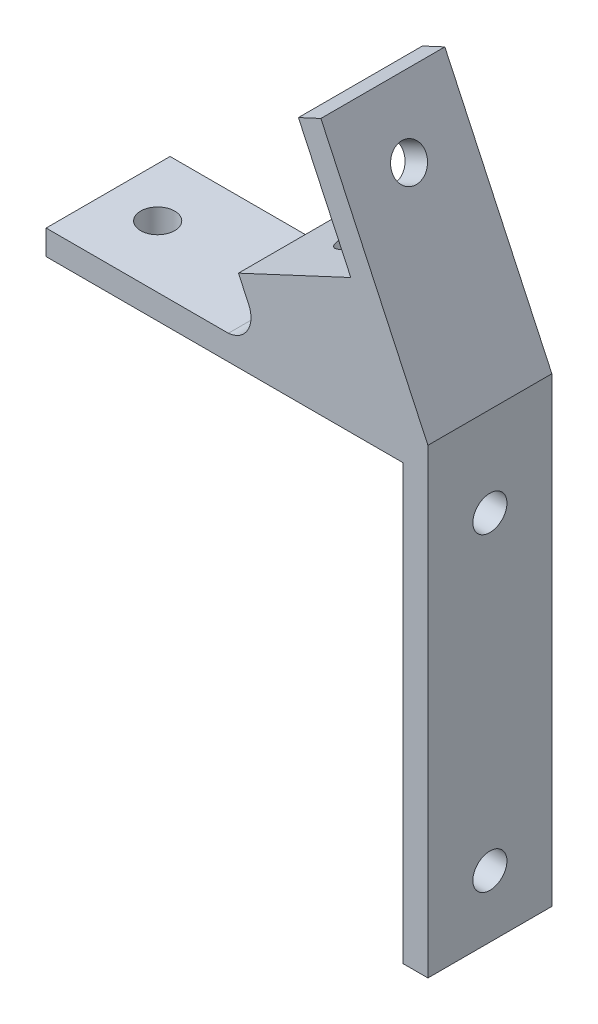
ISO-10303-21;
HEADER;
FILE_DESCRIPTION(('STEP AP214'),'2;1');
FILE_NAME('part.step','',(''),(''),'','','');
FILE_SCHEMA(('AUTOMOTIVE_DESIGN { 1 0 10303 214 1 1 1 1 }'));
ENDSEC;
DATA;
#1=APPLICATION_CONTEXT('core data for automotive mechanical design processes');
#2=APPLICATION_PROTOCOL_DEFINITION('international standard','automotive_design',2000,#1);
#3=PRODUCT_CONTEXT('',#1,'mechanical');
#4=PRODUCT('Part','Part','',(#3));
#5=PRODUCT_RELATED_PRODUCT_CATEGORY('part','',(#4));
#6=PRODUCT_DEFINITION_FORMATION('','',#4);
#7=PRODUCT_DEFINITION_CONTEXT('part definition',#1,'design');
#8=PRODUCT_DEFINITION('design','',#6,#7);
#9=PRODUCT_DEFINITION_SHAPE('','',#8);
#10=(LENGTH_UNIT() NAMED_UNIT(*) SI_UNIT(.MILLI.,.METRE.));
#11=(NAMED_UNIT(*) PLANE_ANGLE_UNIT() SI_UNIT($,.RADIAN.));
#12=(NAMED_UNIT(*) SI_UNIT($,.STERADIAN.) SOLID_ANGLE_UNIT());
#13=UNCERTAINTY_MEASURE_WITH_UNIT(LENGTH_MEASURE(1.E-05),#10,'distance_accuracy_value','');
#14=(GEOMETRIC_REPRESENTATION_CONTEXT(3) GLOBAL_UNCERTAINTY_ASSIGNED_CONTEXT((#13)) GLOBAL_UNIT_ASSIGNED_CONTEXT((#10,
#11,#12)) REPRESENTATION_CONTEXT('',''));
#15=CARTESIAN_POINT('',(0.,0.,0.));
#16=DIRECTION('',(0.,0.,1.));
#17=DIRECTION('',(1.,0.,0.));
#18=AXIS2_PLACEMENT_3D('',#15,#16,#17);
#19=CARTESIAN_POINT('',(-3.99999973673621,0.,20.));
#20=DIRECTION('',(-1.,0.,0.));
#21=DIRECTION('',(0.,0.,1.));
#22=AXIS2_PLACEMENT_3D('',#19,#20,#21);
#23=PLANE('',#22);
#24=CARTESIAN_POINT('',(-3.99999973673621,9.99996286389591,9.9999995));
#25=DIRECTION('',(-1.,0.,0.));
#26=DIRECTION('',(0.,0.,1.));
#27=AXIS2_PLACEMENT_3D('',#24,#25,#26);
#28=CIRCLE('',#27,2.74999594956033);
#29=CARTESIAN_POINT('',(-3.99999973673621,9.99996286389591,12.7499954495603));
#30=VERTEX_POINT('',#29);
#31=EDGE_CURVE('E316',#30,#30,#28,.T.);
#32=ORIENTED_EDGE('',*,*,#31,.F.);
#33=EDGE_LOOP('',(#32));
#34=FACE_BOUND('',#33,.T.);
#35=CARTESIAN_POINT('',(-3.99999973673621,59.9999776734455,9.9999995));
#36=DIRECTION('',(-1.,0.,0.));
#37=DIRECTION('',(0.,0.,1.));
#38=AXIS2_PLACEMENT_3D('',#35,#36,#37);
#39=CIRCLE('',#38,2.74999594960124);
#40=CARTESIAN_POINT('',(-3.99999973673621,59.9999776734455,12.7499954496012));
#41=VERTEX_POINT('',#40);
#42=EDGE_CURVE('E323',#41,#41,#39,.T.);
#43=ORIENTED_EDGE('',*,*,#42,.F.);
#44=EDGE_LOOP('',(#43));
#45=FACE_BOUND('',#44,.T.);
#46=DIRECTION('',(0.,1.,0.));
#47=VECTOR('',#46,1.);
#48=CARTESIAN_POINT('',(-3.99999973673621,0.,0.));
#49=LINE('',#48,#47);
#50=CARTESIAN_POINT('',(-3.99999973673621,0.,0.));
#51=VERTEX_POINT('',#50);
#52=CARTESIAN_POINT('',(-3.99999973673621,69.9999692632638,0.));
#53=VERTEX_POINT('',#52);
#54=EDGE_CURVE('E153',#51,#53,#49,.T.);
#55=ORIENTED_EDGE('',*,*,#54,.F.);
#56=DIRECTION('',(0.,0.,-1.));
#57=VECTOR('',#56,1.);
#58=CARTESIAN_POINT('',(-3.99999973673621,0.,20.));
#59=LINE('',#58,#57);
#60=CARTESIAN_POINT('',(-3.99999973673621,0.,20.));
#61=VERTEX_POINT('',#60);
#62=EDGE_CURVE('E12',#61,#51,#59,.T.);
#63=ORIENTED_EDGE('',*,*,#62,.F.);
#64=DIRECTION('',(0.,1.,0.));
#65=VECTOR('',#64,1.);
#66=CARTESIAN_POINT('',(-3.99999973673621,0.,20.));
#67=LINE('',#66,#65);
#68=CARTESIAN_POINT('',(-3.99999973673621,69.9999692632638,20.));
#69=VERTEX_POINT('',#68);
#70=EDGE_CURVE('E182',#61,#69,#67,.T.);
#71=ORIENTED_EDGE('',*,*,#70,.T.);
#72=DIRECTION('',(0.,0.,-1.));
#73=VECTOR('',#72,1.);
#74=CARTESIAN_POINT('',(-3.99999973673621,69.9999692632638,20.));
#75=LINE('',#74,#73);
#76=EDGE_CURVE('E38',#69,#53,#75,.T.);
#77=ORIENTED_EDGE('',*,*,#76,.T.);
#78=EDGE_LOOP('',(#55,#63,#71,#77));
#79=FACE_BOUND('',#78,.T.);
#80=ADVANCED_FACE('F35',(#34,#45,#79),#23,.T.);
#81=CARTESIAN_POINT('',(0.,0.,20.));
#82=DIRECTION('',(0.,-1.,0.));
#83=DIRECTION('',(1.,0.,0.));
#84=AXIS2_PLACEMENT_3D('',#81,#82,#83);
#85=PLANE('',#84);
#86=DIRECTION('',(-1.,0.,0.));
#87=VECTOR('',#86,1.);
#88=CARTESIAN_POINT('',(0.,0.,0.));
#89=LINE('',#88,#87);
#90=CARTESIAN_POINT('',(0.,0.,0.));
#91=VERTEX_POINT('',#90);
#92=EDGE_CURVE('E180',#91,#51,#89,.T.);
#93=ORIENTED_EDGE('',*,*,#92,.F.);
#94=DIRECTION('',(0.,0.,-1.));
#95=VECTOR('',#94,1.);
#96=CARTESIAN_POINT('',(0.,0.,20.));
#97=LINE('',#96,#95);
#98=CARTESIAN_POINT('',(0.,0.,20.));
#99=VERTEX_POINT('',#98);
#100=EDGE_CURVE('E44',#99,#91,#97,.T.);
#101=ORIENTED_EDGE('',*,*,#100,.F.);
#102=DIRECTION('',(-1.,0.,0.));
#103=VECTOR('',#102,1.);
#104=CARTESIAN_POINT('',(0.,0.,20.));
#105=LINE('',#104,#103);
#106=EDGE_CURVE('E148',#99,#61,#105,.T.);
#107=ORIENTED_EDGE('',*,*,#106,.T.);
#108=ORIENTED_EDGE('',*,*,#62,.T.);
#109=EDGE_LOOP('',(#93,#101,#107,#108));
#110=FACE_BOUND('',#109,.T.);
#111=ADVANCED_FACE('F206',(#110),#85,.T.);
#112=CARTESIAN_POINT('',(0.,74.4401887277319,20.));
#113=DIRECTION('',(1.,0.,0.));
#114=DIRECTION('',(0.,1.,0.));
#115=AXIS2_PLACEMENT_3D('',#112,#113,#114);
#116=PLANE('',#115);
#117=CARTESIAN_POINT('',(0.,9.99996286389591,9.9999995));
#118=DIRECTION('',(1.,0.,0.));
#119=DIRECTION('',(0.,1.,0.));
#120=AXIS2_PLACEMENT_3D('',#117,#118,#119);
#121=CIRCLE('',#120,2.74999594956033);
#122=CARTESIAN_POINT('',(0.,12.7499588134562,9.9999995));
#123=VERTEX_POINT('',#122);
#124=EDGE_CURVE('E313',#123,#123,#121,.F.);
#125=ORIENTED_EDGE('',*,*,#124,.T.);
#126=EDGE_LOOP('',(#125));
#127=FACE_BOUND('',#126,.T.);
#128=CARTESIAN_POINT('',(0.,59.9999776734455,9.9999995));
#129=DIRECTION('',(1.,0.,0.));
#130=DIRECTION('',(0.,1.,0.));
#131=AXIS2_PLACEMENT_3D('',#128,#129,#130);
#132=CIRCLE('',#131,2.74999594960124);
#133=CARTESIAN_POINT('',(0.,62.7499736230467,9.9999995));
#134=VERTEX_POINT('',#133);
#135=EDGE_CURVE('E321',#134,#134,#132,.F.);
#136=ORIENTED_EDGE('',*,*,#135,.T.);
#137=EDGE_LOOP('',(#136));
#138=FACE_BOUND('',#137,.T.);
#139=DIRECTION('',(0.,-1.,0.));
#140=VECTOR('',#139,1.);
#141=CARTESIAN_POINT('',(0.,74.4401887277319,0.));
#142=LINE('',#141,#140);
#143=CARTESIAN_POINT('',(0.,74.4401887277319,0.));
#144=VERTEX_POINT('',#143);
#145=EDGE_CURVE('E134',#144,#91,#142,.T.);
#146=ORIENTED_EDGE('',*,*,#145,.F.);
#147=DIRECTION('',(0.,0.,-1.));
#148=VECTOR('',#147,1.);
#149=CARTESIAN_POINT('',(0.,74.4401887277319,20.));
#150=LINE('',#149,#148);
#151=CARTESIAN_POINT('',(0.,74.4401887277319,20.));
#152=VERTEX_POINT('',#151);
#153=EDGE_CURVE('E128',#152,#144,#150,.T.);
#154=ORIENTED_EDGE('',*,*,#153,.F.);
#155=DIRECTION('',(0.,-1.,0.));
#156=VECTOR('',#155,1.);
#157=CARTESIAN_POINT('',(0.,74.4401887277319,20.));
#158=LINE('',#157,#156);
#159=EDGE_CURVE('E132',#152,#99,#158,.T.);
#160=ORIENTED_EDGE('',*,*,#159,.T.);
#161=ORIENTED_EDGE('',*,*,#100,.T.);
#162=EDGE_LOOP('',(#146,#154,#160,#161));
#163=FACE_BOUND('',#162,.T.);
#164=ADVANCED_FACE('F130',(#127,#138,#163),#116,.T.);
#165=CARTESIAN_POINT('',(0.,74.4401887277319,20.));
#166=DIRECTION('',(-0.906306534690721,-0.422620947394823,0.));
#167=DIRECTION('',(0.422620947394823,-0.906306534690721,0.));
#168=AXIS2_PLACEMENT_3D('',#165,#166,#167);
#169=PLANE('',#168);
#170=CARTESIAN_POINT('',(-13.0466278180074,102.41855591475,10.0000092704325));
#171=DIRECTION('',(0.906306534690721,0.422620947394823,0.));
#172=DIRECTION('',(-0.422620947394823,0.906306534690721,0.));
#173=AXIS2_PLACEMENT_3D('',#170,#171,#172);
#174=CIRCLE('',#173,2.75000820297874);
#175=CARTESIAN_POINT('',(-14.2088388900938,104.910906319563,10.0000092704325));
#176=VERTEX_POINT('',#175);
#177=EDGE_CURVE('E309',#176,#176,#174,.T.);
#178=ORIENTED_EDGE('',*,*,#177,.F.);
#179=EDGE_LOOP('',(#178));
#180=FACE_BOUND('',#179,.T.);
#181=DIRECTION('',(-0.422620947394823,0.906306534690721,0.));
#182=VECTOR('',#181,1.);
#183=CARTESIAN_POINT('',(0.,74.4401887277319,0.));
#184=LINE('',#183,#182);
#185=CARTESIAN_POINT('',(-17.2728230305535,111.481590678218,0.));
#186=VERTEX_POINT('',#185);
#187=EDGE_CURVE('E177',#144,#186,#184,.T.);
#188=ORIENTED_EDGE('',*,*,#187,.T.);
#189=DIRECTION('',(0.,0.,-1.));
#190=VECTOR('',#189,1.);
#191=CARTESIAN_POINT('',(-17.2728230305535,111.481590678218,20.));
#192=LINE('',#191,#190);
#193=CARTESIAN_POINT('',(-17.2728230305535,111.481590678218,20.));
#194=VERTEX_POINT('',#193);
#195=EDGE_CURVE('E137',#194,#186,#192,.T.);
#196=ORIENTED_EDGE('',*,*,#195,.F.);
#197=DIRECTION('',(-0.422620947394823,0.906306534690721,0.));
#198=VECTOR('',#197,1.);
#199=CARTESIAN_POINT('',(0.,74.4401887277319,20.));
#200=LINE('',#199,#198);
#201=EDGE_CURVE('E140',#152,#194,#200,.T.);
#202=ORIENTED_EDGE('',*,*,#201,.F.);
#203=ORIENTED_EDGE('',*,*,#153,.T.);
#204=EDGE_LOOP('',(#188,#196,#202,#203));
#205=FACE_BOUND('',#204,.T.);
#206=ADVANCED_FACE('F141',(#180,#205),#169,.F.);
#207=CARTESIAN_POINT('',(-17.2728230305535,111.481590678218,20.));
#208=DIRECTION('',(0.42262094739482,-0.906306534690722,0.));
#209=DIRECTION('',(0.906306534690722,0.42262094739482,0.));
#210=AXIS2_PLACEMENT_3D('',#207,#208,#209);
#211=PLANE('',#210);
#212=DIRECTION('',(-0.906306534690722,-0.42262094739482,0.));
#213=VECTOR('',#212,1.);
#214=CARTESIAN_POINT('',(-17.2728230305535,111.481590678218,0.));
#215=LINE('',#214,#213);
#216=CARTESIAN_POINT('',(-20.8980489307187,109.7911069999,0.));
#217=VERTEX_POINT('',#216);
#218=EDGE_CURVE('E175',#186,#217,#215,.T.);
#219=ORIENTED_EDGE('',*,*,#218,.T.);
#220=DIRECTION('',(0.,0.,-1.));
#221=VECTOR('',#220,1.);
#222=CARTESIAN_POINT('',(-20.8980489307187,109.7911069999,20.));
#223=LINE('',#222,#221);
#224=CARTESIAN_POINT('',(-20.8980489307187,109.7911069999,20.));
#225=VERTEX_POINT('',#224);
#226=EDGE_CURVE('E186',#225,#217,#223,.T.);
#227=ORIENTED_EDGE('',*,*,#226,.F.);
#228=DIRECTION('',(-0.906306534690722,-0.42262094739482,0.));
#229=VECTOR('',#228,1.);
#230=CARTESIAN_POINT('',(-17.2728230305535,111.481590678218,20.));
#231=LINE('',#230,#229);
#232=EDGE_CURVE('E145',#194,#225,#231,.T.);
#233=ORIENTED_EDGE('',*,*,#232,.F.);
#234=ORIENTED_EDGE('',*,*,#195,.T.);
#235=EDGE_LOOP('',(#219,#227,#233,#234));
#236=FACE_BOUND('',#235,.T.);
#237=ADVANCED_FACE('F221',(#236),#211,.F.);
#238=CARTESIAN_POINT('',(-20.8980489307187,109.7911069999,20.));
#239=DIRECTION('',(0.906306534690721,0.422620947394823,0.));
#240=DIRECTION('',(-0.422620947394823,0.906306534690721,0.));
#241=AXIS2_PLACEMENT_3D('',#238,#239,#240);
#242=PLANE('',#241);
#243=CARTESIAN_POINT('',(-16.6718537181726,100.728072236432,10.0000092704325));
#244=DIRECTION('',(0.906306534690721,0.422620947394823,0.));
#245=DIRECTION('',(-0.422620947394823,0.906306534690721,0.));
#246=AXIS2_PLACEMENT_3D('',#243,#244,#245);
#247=CIRCLE('',#246,2.75000820297874);
#248=CARTESIAN_POINT('',(-17.834064790259,103.220422641244,10.0000092704325));
#249=VERTEX_POINT('',#248);
#250=EDGE_CURVE('E312',#249,#249,#247,.F.);
#251=ORIENTED_EDGE('',*,*,#250,.F.);
#252=EDGE_LOOP('',(#251));
#253=FACE_BOUND('',#252,.T.);
#254=DIRECTION('',(0.422620947394823,-0.906306534690721,0.));
#255=VECTOR('',#254,1.);
#256=CARTESIAN_POINT('',(-20.8980489307187,109.7911069999,0.));
#257=LINE('',#256,#255);
#258=CARTESIAN_POINT('',(-12.4459556601536,91.6656747179731,0.));
#259=VERTEX_POINT('',#258);
#260=EDGE_CURVE('E173',#217,#259,#257,.T.);
#261=ORIENTED_EDGE('',*,*,#260,.T.);
#262=DIRECTION('',(0.,0.,-1.));
#263=VECTOR('',#262,1.);
#264=CARTESIAN_POINT('',(-12.4459556601536,91.6656747179731,20.));
#265=LINE('',#264,#263);
#266=CARTESIAN_POINT('',(-12.4459556601536,91.6656747179731,20.));
#267=VERTEX_POINT('',#266);
#268=EDGE_CURVE('E189',#267,#259,#265,.T.);
#269=ORIENTED_EDGE('',*,*,#268,.F.);
#270=DIRECTION('',(0.422620947394823,-0.906306534690721,0.));
#271=VECTOR('',#270,1.);
#272=CARTESIAN_POINT('',(-20.8980489307187,109.7911069999,20.));
#273=LINE('',#272,#271);
#274=EDGE_CURVE('E362',#225,#267,#273,.T.);
#275=ORIENTED_EDGE('',*,*,#274,.F.);
#276=ORIENTED_EDGE('',*,*,#226,.T.);
#277=EDGE_LOOP('',(#261,#269,#275,#276));
#278=FACE_BOUND('',#277,.T.);
#279=ADVANCED_FACE('F225',(#253,#278),#242,.F.);
#280=CARTESIAN_POINT('',(-12.4459556601536,91.6656747179731,20.));
#281=DIRECTION('',(0.422620947394823,-0.90630653469072,0.));
#282=DIRECTION('',(0.90630653469072,0.422620947394823,0.));
#283=AXIS2_PLACEMENT_3D('',#280,#281,#282);
#284=PLANE('',#283);
#285=CARTESIAN_POINT('',(-21.5099791752381,87.4390184394092,10.0000773023254));
#286=DIRECTION('',(-0.422620947394823,0.90630653469072,0.));
#287=DIRECTION('',(-0.90630653469072,-0.422620947394823,0.));
#288=AXIS2_PLACEMENT_3D('',#285,#286,#287);
#289=CIRCLE('',#288,2.75039095504136);
#290=CARTESIAN_POINT('',(-24.0026764707463,86.2766456082835,10.0000773023254));
#291=VERTEX_POINT('',#290);
#292=EDGE_CURVE('E262',#291,#291,#289,.T.);
#293=ORIENTED_EDGE('',*,*,#292,.F.);
#294=EDGE_LOOP('',(#293));
#295=FACE_BOUND('',#294,.T.);
#296=DIRECTION('',(-0.90630653469072,-0.422620947394823,0.));
#297=VECTOR('',#296,1.);
#298=CARTESIAN_POINT('',(-12.4459556601536,91.6656747179731,0.));
#299=LINE('',#298,#297);
#300=CARTESIAN_POINT('',(-30.5733939999999,83.2126460000002,0.));
#301=VERTEX_POINT('',#300);
#302=EDGE_CURVE('E171',#259,#301,#299,.T.);
#303=ORIENTED_EDGE('',*,*,#302,.T.);
#304=DIRECTION('',(0.,0.,-1.));
#305=VECTOR('',#304,1.);
#306=CARTESIAN_POINT('',(-30.5733939999999,83.2126460000002,20.));
#307=LINE('',#306,#305);
#308=CARTESIAN_POINT('',(-30.5733939999999,83.2126460000002,20.));
#309=VERTEX_POINT('',#308);
#310=EDGE_CURVE('E192',#309,#301,#307,.T.);
#311=ORIENTED_EDGE('',*,*,#310,.F.);
#312=DIRECTION('',(-0.90630653469072,-0.422620947394823,0.));
#313=VECTOR('',#312,1.);
#314=CARTESIAN_POINT('',(-12.4459556601536,91.6656747179731,20.));
#315=LINE('',#314,#313);
#316=EDGE_CURVE('E355',#267,#309,#315,.T.);
#317=ORIENTED_EDGE('',*,*,#316,.F.);
#318=ORIENTED_EDGE('',*,*,#268,.T.);
#319=EDGE_LOOP('',(#303,#311,#317,#318));
#320=FACE_BOUND('',#319,.T.);
#321=ADVANCED_FACE('F229',(#295,#320),#284,.F.);
#322=CARTESIAN_POINT('',(-30.5733939999999,83.2126460000002,20.));
#323=DIRECTION('',(0.906306534690724,0.422620947394816,0.));
#324=DIRECTION('',(-0.422620947394816,0.906306534690724,0.));
#325=AXIS2_PLACEMENT_3D('',#322,#323,#324);
#326=PLANE('',#325);
#327=DIRECTION('',(0.422620947394816,-0.906306534690724,0.));
#328=VECTOR('',#327,1.);
#329=CARTESIAN_POINT('',(-30.5733939999999,83.2126460000002,0.));
#330=LINE('',#329,#328);
#331=CARTESIAN_POINT('',(-28.9238579999999,79.6752320000004,0.));
#332=VERTEX_POINT('',#331);
#333=EDGE_CURVE('E169',#301,#332,#330,.T.);
#334=ORIENTED_EDGE('',*,*,#333,.T.);
#335=DIRECTION('',(0.,0.,-1.));
#336=VECTOR('',#335,1.);
#337=CARTESIAN_POINT('',(-28.9238579999999,79.6752320000004,20.));
#338=LINE('',#337,#336);
#339=CARTESIAN_POINT('',(-28.9238579999999,79.6752320000004,20.));
#340=VERTEX_POINT('',#339);
#341=EDGE_CURVE('E195',#340,#332,#338,.T.);
#342=ORIENTED_EDGE('',*,*,#341,.F.);
#343=DIRECTION('',(0.422620947394816,-0.906306534690724,0.));
#344=VECTOR('',#343,1.);
#345=CARTESIAN_POINT('',(-30.5733939999999,83.2126460000002,20.));
#346=LINE('',#345,#344);
#347=EDGE_CURVE('E345',#309,#340,#346,.T.);
#348=ORIENTED_EDGE('',*,*,#347,.F.);
#349=ORIENTED_EDGE('',*,*,#310,.T.);
#350=EDGE_LOOP('',(#334,#342,#348,#349));
#351=FACE_BOUND('',#350,.T.);
#352=ADVANCED_FACE('F233',(#351),#326,.F.);
#353=CARTESIAN_POINT('',(-32.5490839001651,77.9847483216819,20.));
#354=DIRECTION('',(0.,0.,-1.));
#355=DIRECTION('',(-1.,0.,0.));
#356=AXIS2_PLACEMENT_3D('',#353,#354,#355);
#357=CYLINDRICAL_SURFACE('',#356,3.9999997367362);
#358=CARTESIAN_POINT('',(-32.5490839001651,77.9847483216819,0.));
#359=DIRECTION('',(0.,0.,-1.));
#360=DIRECTION('',(-1.,0.,0.));
#361=AXIS2_PLACEMENT_3D('',#358,#359,#360);
#362=CIRCLE('',#361,3.9999997367362);
#363=CARTESIAN_POINT('',(-32.2004699999997,73.9999690000003,0.));
#364=VERTEX_POINT('',#363);
#365=EDGE_CURVE('E166',#332,#364,#362,.T.);
#366=ORIENTED_EDGE('',*,*,#365,.T.);
#367=DIRECTION('',(0.,0.,-1.));
#368=VECTOR('',#367,1.);
#369=CARTESIAN_POINT('',(-32.2004699999997,73.9999690000003,20.));
#370=LINE('',#369,#368);
#371=CARTESIAN_POINT('',(-32.2004699999997,73.9999690000003,20.));
#372=VERTEX_POINT('',#371);
#373=EDGE_CURVE('E198',#372,#364,#370,.T.);
#374=ORIENTED_EDGE('',*,*,#373,.F.);
#375=CARTESIAN_POINT('',(-32.5490839001651,77.9847483216819,20.));
#376=DIRECTION('',(0.,0.,-1.));
#377=DIRECTION('',(-1.,0.,0.));
#378=AXIS2_PLACEMENT_3D('',#375,#376,#377);
#379=CIRCLE('',#378,3.9999997367362);
#380=EDGE_CURVE('E351',#340,#372,#379,.T.);
#381=ORIENTED_EDGE('',*,*,#380,.F.);
#382=ORIENTED_EDGE('',*,*,#341,.T.);
#383=EDGE_LOOP('',(#366,#374,#381,#382));
#384=FACE_BOUND('',#383,.T.);
#385=ADVANCED_FACE('F237',(#384),#357,.F.);
#386=CARTESIAN_POINT('',(-61.608001,73.999969,20.));
#387=DIRECTION('',(0.,1.,0.));
#388=DIRECTION('',(-1.,0.,0.));
#389=AXIS2_PLACEMENT_3D('',#386,#387,#388);
#390=PLANE('',#389);
#391=CARTESIAN_POINT('',(-53.6079981692755,73.9999690000001,10.0000025668826));
#392=DIRECTION('',(0.,1.,0.));
#393=DIRECTION('',(-1.,0.,0.));
#394=AXIS2_PLACEMENT_3D('',#391,#392,#393);
#395=CIRCLE('',#394,2.75000128893013);
#396=CARTESIAN_POINT('',(-56.3579994582056,73.999969,10.0000025668826));
#397=VERTEX_POINT('',#396);
#398=EDGE_CURVE('E328',#397,#397,#395,.T.);
#399=ORIENTED_EDGE('',*,*,#398,.F.);
#400=EDGE_LOOP('',(#399));
#401=FACE_BOUND('',#400,.T.);
#402=DIRECTION('',(1.,0.,0.));
#403=VECTOR('',#402,1.);
#404=CARTESIAN_POINT('',(-61.608001,73.999969,0.));
#405=LINE('',#404,#403);
#406=CARTESIAN_POINT('',(-61.608001,73.999969,0.));
#407=VERTEX_POINT('',#406);
#408=EDGE_CURVE('E163',#407,#364,#405,.T.);
#409=ORIENTED_EDGE('',*,*,#408,.F.);
#410=DIRECTION('',(0.,0.,-1.));
#411=VECTOR('',#410,1.);
#412=CARTESIAN_POINT('',(-61.608001,73.999969,20.));
#413=LINE('',#412,#411);
#414=CARTESIAN_POINT('',(-61.608001,73.999969,20.));
#415=VERTEX_POINT('',#414);
#416=EDGE_CURVE('E200',#415,#407,#413,.T.);
#417=ORIENTED_EDGE('',*,*,#416,.F.);
#418=DIRECTION('',(1.,0.,0.));
#419=VECTOR('',#418,1.);
#420=CARTESIAN_POINT('',(-61.608001,73.999969,20.));
#421=LINE('',#420,#419);
#422=EDGE_CURVE('E353',#415,#372,#421,.T.);
#423=ORIENTED_EDGE('',*,*,#422,.T.);
#424=ORIENTED_EDGE('',*,*,#373,.T.);
#425=EDGE_LOOP('',(#409,#417,#423,#424));
#426=FACE_BOUND('',#425,.T.);
#427=ADVANCED_FACE('F241',(#401,#426),#390,.T.);
#428=CARTESIAN_POINT('',(-61.608001,69.9999692632638,20.));
#429=DIRECTION('',(-1.,0.,0.));
#430=DIRECTION('',(0.,0.,1.));
#431=AXIS2_PLACEMENT_3D('',#428,#429,#430);
#432=PLANE('',#431);
#433=DIRECTION('',(0.,1.,0.));
#434=VECTOR('',#433,1.);
#435=CARTESIAN_POINT('',(-61.608001,69.9999692632638,0.));
#436=LINE('',#435,#434);
#437=CARTESIAN_POINT('',(-61.608001,69.9999692632638,0.));
#438=VERTEX_POINT('',#437);
#439=EDGE_CURVE('E160',#438,#407,#436,.T.);
#440=ORIENTED_EDGE('',*,*,#439,.F.);
#441=DIRECTION('',(0.,0.,-1.));
#442=VECTOR('',#441,1.);
#443=CARTESIAN_POINT('',(-61.608001,69.9999692632638,20.));
#444=LINE('',#443,#442);
#445=CARTESIAN_POINT('',(-61.608001,69.9999692632638,20.));
#446=VERTEX_POINT('',#445);
#447=EDGE_CURVE('E201',#446,#438,#444,.T.);
#448=ORIENTED_EDGE('',*,*,#447,.F.);
#449=DIRECTION('',(0.,1.,0.));
#450=VECTOR('',#449,1.);
#451=CARTESIAN_POINT('',(-61.608001,69.9999692632638,20.));
#452=LINE('',#451,#450);
#453=EDGE_CURVE('E357',#446,#415,#452,.T.);
#454=ORIENTED_EDGE('',*,*,#453,.T.);
#455=ORIENTED_EDGE('',*,*,#416,.T.);
#456=EDGE_LOOP('',(#440,#448,#454,#455));
#457=FACE_BOUND('',#456,.T.);
#458=ADVANCED_FACE('F245',(#457),#432,.T.);
#459=CARTESIAN_POINT('',(-3.99999973673621,69.9999692632638,20.));
#460=DIRECTION('',(0.,-1.,0.));
#461=DIRECTION('',(1.,0.,0.));
#462=AXIS2_PLACEMENT_3D('',#459,#460,#461);
#463=PLANE('',#462);
#464=CARTESIAN_POINT('',(-53.6079981692755,69.9999692632638,10.0000025668826));
#465=DIRECTION('',(0.,-1.,0.));
#466=DIRECTION('',(1.,0.,0.));
#467=AXIS2_PLACEMENT_3D('',#464,#465,#466);
#468=CIRCLE('',#467,2.75000128893013);
#469=CARTESIAN_POINT('',(-50.8579968803453,69.9999692632638,10.0000025668826));
#470=VERTEX_POINT('',#469);
#471=EDGE_CURVE('E257',#470,#470,#468,.F.);
#472=ORIENTED_EDGE('',*,*,#471,.T.);
#473=EDGE_LOOP('',(#472));
#474=FACE_BOUND('',#473,.T.);
#475=CARTESIAN_POINT('',(-13.3784480000001,69.9999692632638,9.99999934349642));
#476=DIRECTION('',(0.,-1.,0.));
#477=DIRECTION('',(-1.,0.,0.));
#478=AXIS2_PLACEMENT_3D('',#475,#476,#477);
#479=ELLIPSE('',#478,5.51690699999996,5.0000006565039);
#480=CARTESIAN_POINT('',(-18.895355,69.9999692632638,9.99999934349642));
#481=VERTEX_POINT('',#480);
#482=EDGE_CURVE('E260',#481,#481,#479,.T.);
#483=ORIENTED_EDGE('',*,*,#482,.F.);
#484=EDGE_LOOP('',(#483));
#485=FACE_BOUND('',#484,.T.);
#486=DIRECTION('',(-1.,0.,0.));
#487=VECTOR('',#486,1.);
#488=CARTESIAN_POINT('',(-3.99999973673621,69.9999692632638,0.));
#489=LINE('',#488,#487);
#490=EDGE_CURVE('E156',#53,#438,#489,.T.);
#491=ORIENTED_EDGE('',*,*,#490,.F.);
#492=ORIENTED_EDGE('',*,*,#76,.F.);
#493=DIRECTION('',(-1.,0.,0.));
#494=VECTOR('',#493,1.);
#495=CARTESIAN_POINT('',(-3.99999973673621,69.9999692632638,20.));
#496=LINE('',#495,#494);
#497=EDGE_CURVE('E368',#69,#446,#496,.T.);
#498=ORIENTED_EDGE('',*,*,#497,.T.);
#499=ORIENTED_EDGE('',*,*,#447,.T.);
#500=EDGE_LOOP('',(#491,#492,#498,#499));
#501=FACE_BOUND('',#500,.T.);
#502=ADVANCED_FACE('F203',(#474,#485,#501),#463,.T.);
#503=CARTESIAN_POINT('',(-32.5490839001651,77.9847483216819,20.));
#504=DIRECTION('',(0.,0.,-1.));
#505=DIRECTION('',(-1.,0.,0.));
#506=AXIS2_PLACEMENT_3D('',#503,#504,#505);
#507=PLANE('',#506);
#508=ORIENTED_EDGE('',*,*,#70,.F.);
#509=ORIENTED_EDGE('',*,*,#106,.F.);
#510=ORIENTED_EDGE('',*,*,#159,.F.);
#511=ORIENTED_EDGE('',*,*,#201,.T.);
#512=ORIENTED_EDGE('',*,*,#232,.T.);
#513=ORIENTED_EDGE('',*,*,#274,.T.);
#514=ORIENTED_EDGE('',*,*,#316,.T.);
#515=ORIENTED_EDGE('',*,*,#347,.T.);
#516=ORIENTED_EDGE('',*,*,#380,.T.);
#517=ORIENTED_EDGE('',*,*,#422,.F.);
#518=ORIENTED_EDGE('',*,*,#453,.F.);
#519=ORIENTED_EDGE('',*,*,#497,.F.);
#520=EDGE_LOOP('',(#508,#509,#510,#511,#512,#513,#514,#515,#516,#517,#518,#519));
#521=FACE_BOUND('',#520,.T.);
#522=ADVANCED_FACE('F147',(#521),#507,.F.);
#523=CARTESIAN_POINT('',(-32.5490839001651,77.9847483216819,0.));
#524=DIRECTION('',(0.,0.,-1.));
#525=DIRECTION('',(-1.,0.,0.));
#526=AXIS2_PLACEMENT_3D('',#523,#524,#525);
#527=PLANE('',#526);
#528=ORIENTED_EDGE('',*,*,#54,.T.);
#529=ORIENTED_EDGE('',*,*,#490,.T.);
#530=ORIENTED_EDGE('',*,*,#439,.T.);
#531=ORIENTED_EDGE('',*,*,#408,.T.);
#532=ORIENTED_EDGE('',*,*,#365,.F.);
#533=ORIENTED_EDGE('',*,*,#333,.F.);
#534=ORIENTED_EDGE('',*,*,#302,.F.);
#535=ORIENTED_EDGE('',*,*,#260,.F.);
#536=ORIENTED_EDGE('',*,*,#218,.F.);
#537=ORIENTED_EDGE('',*,*,#187,.F.);
#538=ORIENTED_EDGE('',*,*,#145,.T.);
#539=ORIENTED_EDGE('',*,*,#92,.T.);
#540=EDGE_LOOP('',(#528,#529,#530,#531,#532,#533,#534,#535,#536,#537,#538,#539));
#541=FACE_BOUND('',#540,.T.);
#542=ADVANCED_FACE('F205',(#541),#527,.T.);
#543=CARTESIAN_POINT('',(-27.8029590911089,100.935072731319,10.0001376345475));
#544=DIRECTION('',(0.,-1.,0.));
#545=DIRECTION('',(-1.,0.,0.));
#546=AXIS2_PLACEMENT_3D('',#543,#544,#545);
#547=ELLIPSE('',#546,5.51690699999996,5.0000006565039);
#548=DIRECTION('',(0.422599862731309,-0.906316366399208,-4.05156048727137E-06));
#549=VECTOR('',#548,1.);
#550=SURFACE_OF_LINEAR_EXTRUSION('',#547,#549);
#551=CARTESIAN_POINT('',(-24.3511695919409,81.7006215653198,10.0000516496252));
#552=CARTESIAN_POINT('',(-24.3511706497462,81.7006210720533,10.1381381498485));
#553=CARTESIAN_POINT('',(-24.3459832634333,81.7030400087311,10.2762059452685));
#554=CARTESIAN_POINT('',(-24.3252382136416,81.7127136591585,10.5518500740563));
#555=CARTESIAN_POINT('',(-24.3096470448969,81.7199839967911,10.6894233710653));
#556=CARTESIAN_POINT('',(-24.2681576754879,81.7393309571575,10.9627276100764));
#557=CARTESIAN_POINT('',(-24.2422546900746,81.7514098110736,11.0984576665268));
#558=CARTESIAN_POINT('',(-24.1803339064472,81.7802841700663,11.3670202689388));
#559=CARTESIAN_POINT('',(-24.1443202814991,81.7970777291019,11.499853986066));
#560=CARTESIAN_POINT('',(-24.0624076083429,81.8352745314064,11.7618108008841));
#561=CARTESIAN_POINT('',(-24.016505005429,81.8566794322748,11.8909325452971));
#562=CARTESIAN_POINT('',(-23.915157505175,81.9039389134039,12.1444778979182));
#563=CARTESIAN_POINT('',(-23.8597160434953,81.9297918915776,12.268903178069));
#564=CARTESIAN_POINT('',(-23.7396406906703,81.9857843813449,12.5122891750722));
#565=CARTESIAN_POINT('',(-23.6750035069926,82.0159254282834,12.6312479143558));
#566=CARTESIAN_POINT('',(-23.5370231577773,82.0802672195815,12.8627895819759));
#567=CARTESIAN_POINT('',(-23.4636831246263,82.1144665032741,12.975374782897));
#568=CARTESIAN_POINT('',(-23.3087571054164,82.1867102513972,13.1934773966553));
#569=CARTESIAN_POINT('',(-23.2271681695,82.2247560913797,13.2989922585079));
#570=CARTESIAN_POINT('',(-23.0563607533334,82.3044055138205,13.5021443502052));
#571=CARTESIAN_POINT('',(-22.9671450210746,82.3460078148594,13.599784392968));
#572=CARTESIAN_POINT('',(-22.7816414851193,82.4325102035211,13.7865884251313));
#573=CARTESIAN_POINT('',(-22.6853511549531,82.4774114692653,13.8757493601492));
#574=CARTESIAN_POINT('',(-22.4864277911987,82.5701716748149,14.0449090692459));
#575=CARTESIAN_POINT('',(-22.3837970457091,82.6180295476541,14.1249111191453));
#576=CARTESIAN_POINT('',(-22.1728323873144,82.7164047445494,14.2752646908701));
#577=CARTESIAN_POINT('',(-22.0644964409531,82.7669230168288,14.3456127391452));
#578=CARTESIAN_POINT('',(-21.8429435850994,82.8702356094836,14.4761148500092));
#579=CARTESIAN_POINT('',(-21.7297284407304,82.9230291067621,14.5362725609123));
#580=CARTESIAN_POINT('',(-21.4991211619005,83.0305638788561,14.6460291501379));
#581=CARTESIAN_POINT('',(-21.3817275430569,83.0853058458559,14.69562423155));
#582=CARTESIAN_POINT('',(-21.1436556311183,83.1963214604636,14.7838697131676));
#583=CARTESIAN_POINT('',(-21.0229785315416,83.2525945515203,14.8225240335001));
#584=CARTESIAN_POINT('',(-20.779088835704,83.366323064302,14.8886567969808));
#585=CARTESIAN_POINT('',(-20.6558753450992,83.4237789030696,14.9161312245925));
#586=CARTESIAN_POINT('',(-20.4078500177676,83.5394359074082,14.9596863135928));
#587=CARTESIAN_POINT('',(-20.2830387702884,83.5976367982063,14.9757710588453));
#588=CARTESIAN_POINT('',(-20.0325941575952,83.7144219425642,14.9964566656967));
#589=CARTESIAN_POINT('',(-19.9069605134321,83.773006326201,15.0010534041616));
#590=CARTESIAN_POINT('',(-19.6558179123714,83.890116950398,14.9987151305956));
#591=CARTESIAN_POINT('',(-19.5303089269125,83.9486432042766,14.9917842546459));
#592=CARTESIAN_POINT('',(-19.2802323740467,84.0652567181906,14.9664589062501));
#593=CARTESIAN_POINT('',(-19.1556651606351,84.1233438131537,14.9480603209255));
#594=CARTESIAN_POINT('',(-18.7847675210151,84.2962975609673,14.8758093302628));
#595=CARTESIAN_POINT('',(-18.5409759637714,84.4099803106171,14.8048989682921));
#596=CARTESIAN_POINT('',(-18.0675215778869,84.6307574245977,14.6195687708251));
#597=CARTESIAN_POINT('',(-17.837858749679,84.7378517887266,14.5051489339955));
#598=CARTESIAN_POINT('',(-17.3988271758287,84.9425771576551,14.2359406055855));
#599=CARTESIAN_POINT('',(-17.1894584309806,85.0402081620842,14.081152112425));
#600=CARTESIAN_POINT('',(-16.7968348276728,85.2232929715258,13.7354792428217));
#601=CARTESIAN_POINT('',(-16.6135799703453,85.3087467760103,13.5445948648141));
#602=CARTESIAN_POINT('',(-16.2782264746,85.4651258891019,13.1319936488469));
#603=CARTESIAN_POINT('',(-16.1261278375163,85.5360511970869,12.9102768095673));
#604=CARTESIAN_POINT('',(-15.8572852400153,85.6614155290286,12.4421259317836));
#605=CARTESIAN_POINT('',(-15.7405412809269,85.7158545523657,12.1956918923505));
#606=CARTESIAN_POINT('',(-15.5456272850338,85.8067451445128,11.684903375674));
#607=CARTESIAN_POINT('',(-15.4674572490878,85.8431967129225,11.4205488980316));
#608=CARTESIAN_POINT('',(-15.3518475870816,85.8971068007513,10.8812112779625));
#609=CARTESIAN_POINT('',(-15.3144078823934,85.9145653568357,10.606228156055));
#610=CARTESIAN_POINT('',(-15.2812912863971,85.9300079986337,10.0532171408594));
#611=CARTESIAN_POINT('',(-15.2856143951568,85.9279920843158,9.77518924756647));
#612=CARTESIAN_POINT('',(-15.3359039391939,85.9045415033793,9.22375718010741));
#613=CARTESIAN_POINT('',(-15.3818703739413,85.8831068370079,8.95035300588248));
#614=CARTESIAN_POINT('',(-15.514179433109,85.8214096321506,8.41570882727283));
#615=CARTESIAN_POINT('',(-15.6005220564925,85.7811470941481,8.15446882257572));
#616=CARTESIAN_POINT('',(-15.8111988542296,85.6829061299205,7.6513594983509));
#617=CARTESIAN_POINT('',(-15.9355330272224,85.6249277043301,7.40949017812929));
#618=CARTESIAN_POINT('',(-16.2187747820237,85.4928488831211,6.95178808580516));
#619=CARTESIAN_POINT('',(-16.3776823623789,85.4187484881804,6.73595531260808));
#620=CARTESIAN_POINT('',(-16.7256457981924,85.2564892179739,6.33629728760659));
#621=CARTESIAN_POINT('',(-16.9147016523349,85.1683303433218,6.15247203440506));
#622=CARTESIAN_POINT('',(-17.3179047532059,84.98031219498,5.82183002564378));
#623=CARTESIAN_POINT('',(-17.5320519989188,84.8804529217639,5.67501326858598));
#624=CARTESIAN_POINT('',(-17.8673376495135,84.7241054456303,5.48570769215058));
#625=CARTESIAN_POINT('',(-17.9815068384316,84.6708670666306,5.4277369543353));
#626=CARTESIAN_POINT('',(-18.213800618446,84.5625458600344,5.32245548712748));
#627=CARTESIAN_POINT('',(-18.3319237759474,84.5074637009396,5.27514094117878));
#628=CARTESIAN_POINT('',(-18.5713578322175,84.3958129030846,5.19148625521717));
#629=CARTESIAN_POINT('',(-18.692669859626,84.3392437380269,5.15515005921442));
#630=CARTESIAN_POINT('',(-18.9375678192562,84.2250450604798,5.09372921007131));
#631=CARTESIAN_POINT('',(-19.0611529201601,84.1674159356432,5.06864052539573));
#632=CARTESIAN_POINT('',(-19.3098283514214,84.0514557805184,5.02986394739922));
#633=CARTESIAN_POINT('',(-19.4349192060086,83.9931245057757,5.0161801484249));
#634=CARTESIAN_POINT('',(-19.6856538235802,83.8762041288759,5.00032532582556));
#635=CARTESIAN_POINT('',(-19.8112973721244,83.8176151267146,4.99815017402653));
#636=CARTESIAN_POINT('',(-20.0623594717515,83.700542041243,5.00531800170644));
#637=CARTESIAN_POINT('',(-20.1877779259097,83.6420580031297,5.01466511491737));
#638=CARTESIAN_POINT('',(-20.4374331629996,83.5256409535087,5.0448144223911));
#639=CARTESIAN_POINT('',(-20.5616703536909,83.4677077518579,5.06561250618438));
#640=CARTESIAN_POINT('',(-20.8081952631182,83.3527504092915,5.11852689189378));
#641=CARTESIAN_POINT('',(-20.9304822662166,83.2957266020858,5.1506472530691));
#642=CARTESIAN_POINT('',(-21.1721727168303,83.1830236221282,5.22596935614072));
#643=CARTESIAN_POINT('',(-21.2915771830329,83.1273439743511,5.26916711865495));
#644=CARTESIAN_POINT('',(-21.526765882021,83.017672834424,5.36636884405439));
#645=CARTESIAN_POINT('',(-21.6425488001128,82.9636819553305,5.42037667975394));
#646=CARTESIAN_POINT('',(-21.869608707143,82.8578013626708,5.53879441611373));
#647=CARTESIAN_POINT('',(-21.9808872976217,82.8059109022881,5.60320057822449));
#648=CARTESIAN_POINT('',(-22.1982532971336,82.7045506879138,5.74200906145274));
#649=CARTESIAN_POINT('',(-22.304338828629,82.6550818094391,5.81641496206359));
#650=CARTESIAN_POINT('',(-22.5105058319965,82.5589438131325,5.97466262276141));
#651=CARTESIAN_POINT('',(-22.610589444112,82.512273697281,6.05850098825304));
#652=CARTESIAN_POINT('',(-22.8041376793511,82.4220199747132,6.23508813454191));
#653=CARTESIAN_POINT('',(-22.8975999139051,82.3784374818138,6.32784010265037));
#654=CARTESIAN_POINT('',(-23.0771877579851,82.2946936469185,6.52155343297516));
#655=CARTESIAN_POINT('',(-23.1633159873538,82.2545310832604,6.62251183829658));
#656=CARTESIAN_POINT('',(-23.327708168651,82.177873157112,6.83200754526992));
#657=CARTESIAN_POINT('',(-23.4059692876994,82.1413791156256,6.94054755331734));
#658=CARTESIAN_POINT('',(-23.554024675625,82.0723392202735,7.16438403584365));
#659=CARTESIAN_POINT('',(-23.6238219700531,82.0397919555593,7.27967807398181));
#660=CARTESIAN_POINT('',(-23.7545153006862,81.97884818312,7.51628905794961));
#661=CARTESIAN_POINT('',(-23.8154093099956,81.9504526205593,7.63760736685193));
#662=CARTESIAN_POINT('',(-23.9278509807448,81.8980198027435,7.88539186263656));
#663=CARTESIAN_POINT('',(-23.9793995373502,81.8739821300627,8.01185755504802));
#664=CARTESIAN_POINT('',(-24.072794976651,81.8304307845424,8.26905890628355));
#665=CARTESIAN_POINT('',(-24.1146432712518,81.8109164533155,8.39979394052636));
#666=CARTESIAN_POINT('',(-24.1883719084781,81.7765359591648,8.66468754107195));
#667=CARTESIAN_POINT('',(-24.2202483846506,81.7616715992115,8.79884741356136));
#668=CARTESIAN_POINT('',(-24.2816080947342,81.7330588751332,9.10917314627469));
#669=CARTESIAN_POINT('',(-24.3076789032055,81.7209017634346,9.28617321241816));
#670=CARTESIAN_POINT('',(-24.3424543942295,81.7046855601963,9.64214393038962));
#671=CARTESIAN_POINT('',(-24.3511682211934,81.7006222045148,9.82111349459782));
#672=CARTESIAN_POINT('',(-24.3511695919409,81.7006215653198,10.0000516496252));
#673=B_SPLINE_CURVE_WITH_KNOTS('',3,(#551,#552,#553,#554,#555,#556,#557,#558,#559,#560,#561,
#562,#563,#564,#565,#566,#567,#568,#569,#570,#571,#572,#573,#574,#575,#576,#577,#578,#579,#580,
#581,#582,#583,#584,#585,#586,#587,#588,#589,#590,#591,#592,#593,#594,#595,#596,#597,#598,#599,
#600,#601,#602,#603,#604,#605,#606,#607,#608,#609,#610,#611,#612,#613,#614,#615,#616,#617,#618,
#619,#620,#621,#622,#623,#624,#625,#626,#627,#628,#629,#630,#631,#632,#633,#634,#635,#636,#637,
#638,#639,#640,#641,#642,#643,#644,#645,#646,#647,#648,#649,#650,#651,#652,#653,#654,#655,#656,
#657,#658,#659,#660,#661,#662,#663,#664,#665,#666,#667,#668,#669,#670,#671,#672),.UNSPECIFIED.,
.T.,.F.,(4,2,2,2,2,2,2,2,2,2,2,2,2,2,2,2,2,2,2,2,2,2,2,2,2,2,2,2,2,2,2,2,2,2,2,2,2,2,2,2,2,2,2,
2,2,2,2,2,2,2,2,2,2,2,2,2,2,2,2,2,4),(0.,0.414108945944347,0.829558003311624,1.24520005680483,
1.66067080153981,2.07629114189958,2.49176209830397,2.90738219042862,3.32285314101839,
3.73847319561375,4.15394412533611,4.56956415542594,4.98503506490608,5.40065507280728,
5.8161259657327,6.23174595534831,6.64721683727055,7.06283681445625,7.47830769213503,
7.8939276641053,8.30939854476524,8.72501851930579,9.55539155936786,10.3857646248722,
11.2161377228769,12.0465108568795,12.8768840264337,13.7072572271982,14.5376304464456,
15.3680020626906,16.1983736802857,17.0287452873149,17.8591168730199,18.6894884289792,
19.5198599500306,20.3502314348366,21.1806028860305,21.59622205971,22.0116921402239,
22.4273113028068,22.8427813723546,23.2584005312218,23.6738705965804,24.08948975952,
24.5049598279254,24.9205790022788,25.3360490806336,25.7516682724832,26.167138366609,
26.582757579967,26.998227694111,27.4138469280988,27.8293170668499,28.2449362809708,
28.6604064835799,29.0759711241285,29.4914959382564,29.9069602333341,30.3225854206114,
30.8594877290288,31.3961070991176),.UNSPECIFIED.);
#674=CARTESIAN_POINT('',(-24.3511695919409,81.7006215653198,10.0000516496252));
#675=VERTEX_POINT('',#674);
#676=EDGE_CURVE('E157',#675,#675,#673,.T.);
#677=ORIENTED_EDGE('',*,*,#676,.T.);
#678=EDGE_LOOP('',(#677));
#679=FACE_BOUND('',#678,.T.);
#680=ORIENTED_EDGE('',*,*,#482,.T.);
#681=EDGE_LOOP('',(#680));
#682=FACE_BOUND('',#681,.T.);
#683=ADVANCED_FACE('F278',(#679,#682),#550,.F.);
#684=CARTESIAN_POINT('',(-10.7554718705743,88.0404485792102,20.));
#685=DIRECTION('',(0.422620947394823,-0.90630653469072,0.));
#686=DIRECTION('',(0.90630653469072,0.422620947394823,0.));
#687=AXIS2_PLACEMENT_3D('',#684,#685,#686);
#688=PLANE('',#687);
#689=CARTESIAN_POINT('',(-19.8194953856588,83.8137923006463,10.0000773023254));
#690=DIRECTION('',(0.422620947394823,-0.90630653469072,0.));
#691=DIRECTION('',(0.90630653469072,0.422620947394823,0.));
#692=AXIS2_PLACEMENT_3D('',#689,#690,#691);
#693=CIRCLE('',#692,2.75039095504136);
#694=CARTESIAN_POINT('',(-17.3267980901506,84.9761651317721,10.0000773023254));
#695=VERTEX_POINT('',#694);
#696=EDGE_CURVE('E267',#695,#695,#693,.F.);
#697=ORIENTED_EDGE('',*,*,#696,.T.);
#698=EDGE_LOOP('',(#697));
#699=FACE_BOUND('',#698,.T.);
#700=ORIENTED_EDGE('',*,*,#676,.F.);
#701=EDGE_LOOP('',(#700));
#702=FACE_BOUND('',#701,.T.);
#703=ADVANCED_FACE('F280',(#699,#702),#688,.T.);
#704=CARTESIAN_POINT('',(15.82370046796,7.37730348359535,10.0000773023254));
#705=DIRECTION('',(-0.422620947394823,0.90630653469072,0.));
#706=DIRECTION('',(-0.90630653469072,-0.422620947394823,0.));
#707=AXIS2_PLACEMENT_3D('',#704,#705,#706);
#708=CYLINDRICAL_SURFACE('',#707,2.75039095504136);
#709=ORIENTED_EDGE('',*,*,#696,.F.);
#710=EDGE_LOOP('',(#709));
#711=FACE_BOUND('',#710,.T.);
#712=ORIENTED_EDGE('',*,*,#292,.T.);
#713=EDGE_LOOP('',(#712));
#714=FACE_BOUND('',#713,.T.);
#715=ADVANCED_FACE('F284',(#711,#714),#708,.F.);
#716=CARTESIAN_POINT('',(-53.6079981692748,-0.0010000000005006,10.0000025668826));
#717=DIRECTION('',(0.,1.,0.));
#718=DIRECTION('',(-1.,0.,0.));
#719=AXIS2_PLACEMENT_3D('',#716,#717,#718);
#720=CYLINDRICAL_SURFACE('',#719,2.75000128893013);
#721=ORIENTED_EDGE('',*,*,#471,.F.);
#722=EDGE_LOOP('',(#721));
#723=FACE_BOUND('',#722,.T.);
#724=ORIENTED_EDGE('',*,*,#398,.T.);
#725=EDGE_LOOP('',(#724));
#726=FACE_BOUND('',#725,.T.);
#727=ADVANCED_FACE('F288',(#723,#726),#720,.F.);
#728=CARTESIAN_POINT('',(0.00100000000000013,59.9999776734455,9.9999995));
#729=DIRECTION('',(-1.,0.,0.));
#730=DIRECTION('',(0.,0.,1.));
#731=AXIS2_PLACEMENT_3D('',#728,#729,#730);
#732=CYLINDRICAL_SURFACE('',#731,2.74999594960124);
#733=ORIENTED_EDGE('',*,*,#135,.F.);
#734=EDGE_LOOP('',(#733));
#735=FACE_BOUND('',#734,.T.);
#736=ORIENTED_EDGE('',*,*,#42,.T.);
#737=EDGE_LOOP('',(#736));
#738=FACE_BOUND('',#737,.T.);
#739=ADVANCED_FACE('F292',(#735,#738),#732,.F.);
#740=CARTESIAN_POINT('',(0.00100000000000013,9.99996286389591,9.9999995));
#741=DIRECTION('',(-1.,0.,0.));
#742=DIRECTION('',(0.,0.,1.));
#743=AXIS2_PLACEMENT_3D('',#740,#741,#742);
#744=CYLINDRICAL_SURFACE('',#743,2.74999594956033);
#745=ORIENTED_EDGE('',*,*,#124,.F.);
#746=EDGE_LOOP('',(#745));
#747=FACE_BOUND('',#746,.T.);
#748=ORIENTED_EDGE('',*,*,#31,.T.);
#749=EDGE_LOOP('',(#748));
#750=FACE_BOUND('',#749,.T.);
#751=ADVANCED_FACE('F296',(#747,#750),#744,.F.);
#752=CARTESIAN_POINT('',(-92.1645109830599,65.5249956686048,10.0000092704325));
#753=DIRECTION('',(0.906306534690721,0.422620947394823,0.));
#754=DIRECTION('',(-0.422620947394823,0.906306534690721,0.));
#755=AXIS2_PLACEMENT_3D('',#752,#753,#754);
#756=CYLINDRICAL_SURFACE('',#755,2.75000820297874);
#757=ORIENTED_EDGE('',*,*,#177,.T.);
#758=EDGE_LOOP('',(#757));
#759=FACE_BOUND('',#758,.T.);
#760=ORIENTED_EDGE('',*,*,#250,.T.);
#761=EDGE_LOOP('',(#760));
#762=FACE_BOUND('',#761,.T.);
#763=ADVANCED_FACE('F300',(#759,#762),#756,.F.);
#764=CLOSED_SHELL('',(#80,#111,#164,#206,#237,#279,#321,#352,#385,#427,#458,#502,#522,#542,#683,
#703,#715,#727,#739,#751,#763));
#765=MANIFOLD_SOLID_BREP('B2',#764);
#766=ADVANCED_BREP_SHAPE_REPRESENTATION('',(#18,#765),#14);
#767=SHAPE_DEFINITION_REPRESENTATION(#9,#766);
ENDSEC;
END-ISO-10303-21;
